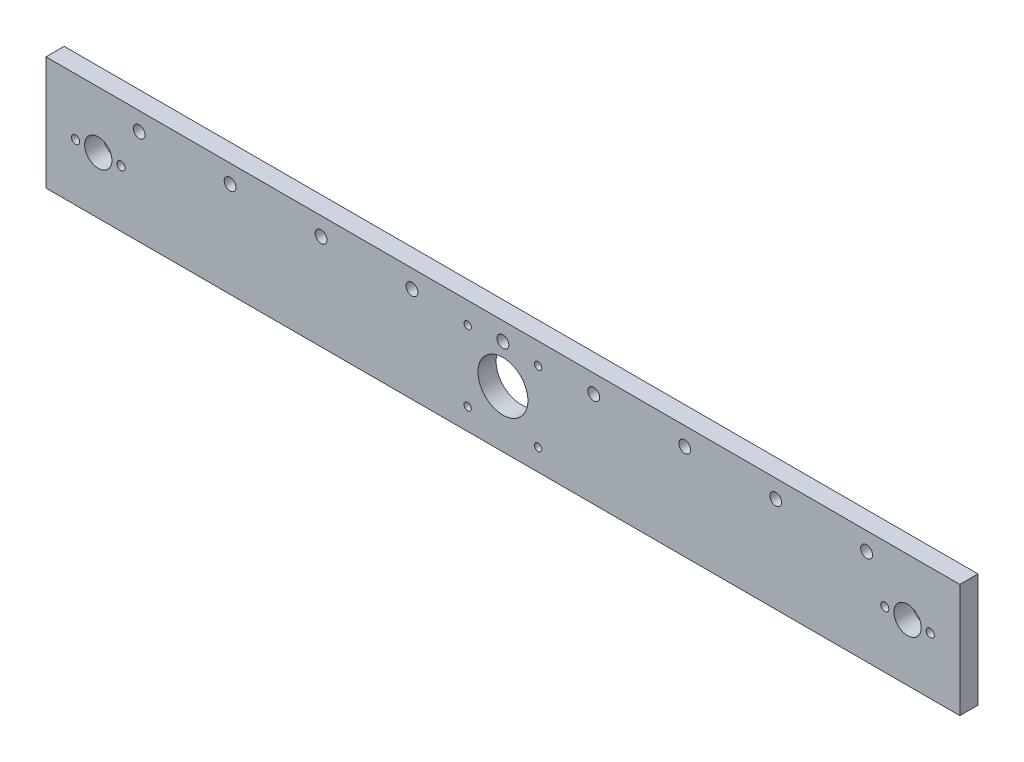
ISO-10303-21;
HEADER;
FILE_DESCRIPTION(('STEP AP214'),'2;1');
FILE_NAME('part.step','',(''),(''),'','','');
FILE_SCHEMA(('AUTOMOTIVE_DESIGN { 1 0 10303 214 1 1 1 1 }'));
ENDSEC;
DATA;
#1=APPLICATION_CONTEXT('core data for automotive mechanical design processes');
#2=APPLICATION_PROTOCOL_DEFINITION('international standard','automotive_design',2000,#1);
#3=PRODUCT_CONTEXT('',#1,'mechanical');
#4=PRODUCT('Part','Part','',(#3));
#5=PRODUCT_RELATED_PRODUCT_CATEGORY('part','',(#4));
#6=PRODUCT_DEFINITION_FORMATION('','',#4);
#7=PRODUCT_DEFINITION_CONTEXT('part definition',#1,'design');
#8=PRODUCT_DEFINITION('design','',#6,#7);
#9=PRODUCT_DEFINITION_SHAPE('','',#8);
#10=(LENGTH_UNIT() NAMED_UNIT(*) SI_UNIT(.MILLI.,.METRE.));
#11=(NAMED_UNIT(*) PLANE_ANGLE_UNIT() SI_UNIT($,.RADIAN.));
#12=(NAMED_UNIT(*) SI_UNIT($,.STERADIAN.) SOLID_ANGLE_UNIT());
#13=UNCERTAINTY_MEASURE_WITH_UNIT(LENGTH_MEASURE(1.E-05),#10,'distance_accuracy_value','');
#14=(GEOMETRIC_REPRESENTATION_CONTEXT(3) GLOBAL_UNCERTAINTY_ASSIGNED_CONTEXT((#13)) GLOBAL_UNIT_ASSIGNED_CONTEXT((#10,
#11,#12)) REPRESENTATION_CONTEXT('',''));
#15=CARTESIAN_POINT('',(0.,0.,0.));
#16=DIRECTION('',(0.,0.,1.));
#17=DIRECTION('',(1.,0.,0.));
#18=AXIS2_PLACEMENT_3D('',#15,#16,#17);
#19=CARTESIAN_POINT('',(0.,0.,8.));
#20=DIRECTION('',(0.,0.,-1.));
#21=DIRECTION('',(-1.,0.,0.));
#22=AXIS2_PLACEMENT_3D('',#19,#20,#21);
#23=PLANE('',#22);
#24=CARTESIAN_POINT('',(-120.,17.,8.));
#25=DIRECTION('',(0.,0.,1.));
#26=DIRECTION('',(1.,0.,0.));
#27=AXIS2_PLACEMENT_3D('',#24,#25,#26);
#28=CIRCLE('',#27,2.6);
#29=CARTESIAN_POINT('',(-117.4,17.,8.));
#30=VERTEX_POINT('',#29);
#31=EDGE_CURVE('E217',#30,#30,#28,.T.);
#32=ORIENTED_EDGE('',*,*,#31,.F.);
#33=EDGE_LOOP('',(#32));
#34=FACE_BOUND('',#33,.T.);
#35=CARTESIAN_POINT('',(-40.,17.,8.));
#36=DIRECTION('',(0.,0.,1.));
#37=DIRECTION('',(1.,0.,0.));
#38=AXIS2_PLACEMENT_3D('',#35,#36,#37);
#39=CIRCLE('',#38,2.6);
#40=CARTESIAN_POINT('',(-37.4,17.,8.));
#41=VERTEX_POINT('',#40);
#42=EDGE_CURVE('E205',#41,#41,#39,.T.);
#43=ORIENTED_EDGE('',*,*,#42,.F.);
#44=EDGE_LOOP('',(#43));
#45=FACE_BOUND('',#44,.T.);
#46=CARTESIAN_POINT('',(120.,17.,8.));
#47=DIRECTION('',(0.,0.,1.));
#48=DIRECTION('',(1.,0.,0.));
#49=AXIS2_PLACEMENT_3D('',#46,#47,#48);
#50=CIRCLE('',#49,2.6);
#51=CARTESIAN_POINT('',(122.6,17.,8.));
#52=VERTEX_POINT('',#51);
#53=EDGE_CURVE('E193',#52,#52,#50,.T.);
#54=ORIENTED_EDGE('',*,*,#53,.F.);
#55=EDGE_LOOP('',(#54));
#56=FACE_BOUND('',#55,.T.);
#57=CARTESIAN_POINT('',(40.,17.,8.));
#58=DIRECTION('',(0.,0.,1.));
#59=DIRECTION('',(1.,0.,0.));
#60=AXIS2_PLACEMENT_3D('',#57,#58,#59);
#61=CIRCLE('',#60,2.6);
#62=CARTESIAN_POINT('',(42.6,17.,8.));
#63=VERTEX_POINT('',#62);
#64=EDGE_CURVE('E181',#63,#63,#61,.T.);
#65=ORIENTED_EDGE('',*,*,#64,.F.);
#66=EDGE_LOOP('',(#65));
#67=FACE_BOUND('',#66,.T.);
#68=CARTESIAN_POINT('',(15.5,-15.5,8.));
#69=DIRECTION('',(0.,0.,1.));
#70=DIRECTION('',(1.,0.,0.));
#71=AXIS2_PLACEMENT_3D('',#68,#69,#70);
#72=CIRCLE('',#71,1.6);
#73=CARTESIAN_POINT('',(17.1,-15.5,8.));
#74=VERTEX_POINT('',#73);
#75=EDGE_CURVE('E169',#74,#74,#72,.T.);
#76=ORIENTED_EDGE('',*,*,#75,.F.);
#77=EDGE_LOOP('',(#76));
#78=FACE_BOUND('',#77,.T.);
#79=CARTESIAN_POINT('',(15.5,15.5,8.));
#80=DIRECTION('',(0.,0.,1.));
#81=DIRECTION('',(1.,0.,0.));
#82=AXIS2_PLACEMENT_3D('',#79,#80,#81);
#83=CIRCLE('',#82,1.6);
#84=CARTESIAN_POINT('',(17.1,15.5,8.));
#85=VERTEX_POINT('',#84);
#86=EDGE_CURVE('E157',#85,#85,#83,.T.);
#87=ORIENTED_EDGE('',*,*,#86,.F.);
#88=EDGE_LOOP('',(#87));
#89=FACE_BOUND('',#88,.T.);
#90=CARTESIAN_POINT('',(178.,0.,8.));
#91=DIRECTION('',(0.,0.,1.));
#92=DIRECTION('',(-1.,0.,0.));
#93=AXIS2_PLACEMENT_3D('',#90,#91,#92);
#94=CIRCLE('',#93,6.00000000000004);
#95=CARTESIAN_POINT('',(172.,0.,8.));
#96=VERTEX_POINT('',#95);
#97=EDGE_CURVE('E145',#96,#96,#94,.T.);
#98=ORIENTED_EDGE('',*,*,#97,.F.);
#99=EDGE_LOOP('',(#98));
#100=FACE_BOUND('',#99,.T.);
#101=CARTESIAN_POINT('',(-168.,0.,8.));
#102=DIRECTION('',(0.,0.,1.));
#103=DIRECTION('',(1.,0.,0.));
#104=AXIS2_PLACEMENT_3D('',#101,#102,#103);
#105=CIRCLE('',#104,1.80000000000001);
#106=CARTESIAN_POINT('',(-166.2,0.,8.));
#107=VERTEX_POINT('',#106);
#108=EDGE_CURVE('E133',#107,#107,#105,.T.);
#109=ORIENTED_EDGE('',*,*,#108,.F.);
#110=EDGE_LOOP('',(#109));
#111=FACE_BOUND('',#110,.T.);
#112=CARTESIAN_POINT('',(0.,0.,8.));
#113=DIRECTION('',(0.,0.,1.));
#114=DIRECTION('',(1.,0.,0.));
#115=AXIS2_PLACEMENT_3D('',#112,#113,#114);
#116=CIRCLE('',#115,11.);
#117=CARTESIAN_POINT('',(11.,0.,8.));
#118=VERTEX_POINT('',#117);
#119=EDGE_CURVE('E121',#118,#118,#116,.T.);
#120=ORIENTED_EDGE('',*,*,#119,.F.);
#121=EDGE_LOOP('',(#120));
#122=FACE_BOUND('',#121,.T.);
#123=CARTESIAN_POINT('',(-178.,0.,8.));
#124=DIRECTION('',(0.,0.,1.));
#125=DIRECTION('',(1.,0.,0.));
#126=AXIS2_PLACEMENT_3D('',#123,#124,#125);
#127=CIRCLE('',#126,5.99999999999999);
#128=CARTESIAN_POINT('',(-172.,0.,8.));
#129=VERTEX_POINT('',#128);
#130=EDGE_CURVE('E100',#129,#129,#127,.T.);
#131=ORIENTED_EDGE('',*,*,#130,.F.);
#132=EDGE_LOOP('',(#131));
#133=FACE_BOUND('',#132,.T.);
#134=DIRECTION('',(0.,1.,0.));
#135=VECTOR('',#134,1.);
#136=CARTESIAN_POINT('',(201.,-25.,8.));
#137=LINE('',#136,#135);
#138=CARTESIAN_POINT('',(201.,-25.,8.));
#139=VERTEX_POINT('',#138);
#140=CARTESIAN_POINT('',(201.,25.,8.));
#141=VERTEX_POINT('',#140);
#142=EDGE_CURVE('E85',#139,#141,#137,.T.);
#143=ORIENTED_EDGE('',*,*,#142,.T.);
#144=DIRECTION('',(-1.,0.,0.));
#145=VECTOR('',#144,1.);
#146=CARTESIAN_POINT('',(-201.,25.,8.));
#147=LINE('',#146,#145);
#148=CARTESIAN_POINT('',(-201.,25.,8.));
#149=VERTEX_POINT('',#148);
#150=EDGE_CURVE('E80',#141,#149,#147,.T.);
#151=ORIENTED_EDGE('',*,*,#150,.T.);
#152=DIRECTION('',(0.,-1.,0.));
#153=VECTOR('',#152,1.);
#154=CARTESIAN_POINT('',(-201.,-25.,8.));
#155=LINE('',#154,#153);
#156=CARTESIAN_POINT('',(-201.,-25.,8.));
#157=VERTEX_POINT('',#156);
#158=EDGE_CURVE('E83',#149,#157,#155,.T.);
#159=ORIENTED_EDGE('',*,*,#158,.T.);
#160=DIRECTION('',(1.,0.,0.));
#161=VECTOR('',#160,1.);
#162=CARTESIAN_POINT('',(-201.,-25.,8.));
#163=LINE('',#162,#161);
#164=EDGE_CURVE('E50',#157,#139,#163,.T.);
#165=ORIENTED_EDGE('',*,*,#164,.T.);
#166=EDGE_LOOP('',(#143,#151,#159,#165));
#167=FACE_BOUND('',#166,.T.);
#168=CARTESIAN_POINT('',(168.,0.,8.));
#169=DIRECTION('',(0.,0.,1.));
#170=DIRECTION('',(-1.,0.,0.));
#171=AXIS2_PLACEMENT_3D('',#168,#169,#170);
#172=CIRCLE('',#171,1.80000000000001);
#173=CARTESIAN_POINT('',(166.2,0.,8.));
#174=VERTEX_POINT('',#173);
#175=EDGE_CURVE('E115',#174,#174,#172,.T.);
#176=ORIENTED_EDGE('',*,*,#175,.F.);
#177=EDGE_LOOP('',(#176));
#178=FACE_BOUND('',#177,.T.);
#179=CARTESIAN_POINT('',(-188.,0.,8.));
#180=DIRECTION('',(0.,0.,1.));
#181=DIRECTION('',(1.,0.,0.));
#182=AXIS2_PLACEMENT_3D('',#179,#180,#181);
#183=CIRCLE('',#182,1.80000000000001);
#184=CARTESIAN_POINT('',(-186.2,0.,8.));
#185=VERTEX_POINT('',#184);
#186=EDGE_CURVE('E127',#185,#185,#183,.T.);
#187=ORIENTED_EDGE('',*,*,#186,.F.);
#188=EDGE_LOOP('',(#187));
#189=FACE_BOUND('',#188,.T.);
#190=CARTESIAN_POINT('',(188.,0.,8.));
#191=DIRECTION('',(0.,0.,1.));
#192=DIRECTION('',(-1.,0.,0.));
#193=AXIS2_PLACEMENT_3D('',#190,#191,#192);
#194=CIRCLE('',#193,1.80000000000001);
#195=CARTESIAN_POINT('',(186.2,0.,8.));
#196=VERTEX_POINT('',#195);
#197=EDGE_CURVE('E139',#196,#196,#194,.T.);
#198=ORIENTED_EDGE('',*,*,#197,.F.);
#199=EDGE_LOOP('',(#198));
#200=FACE_BOUND('',#199,.T.);
#201=CARTESIAN_POINT('',(-15.5,15.5,8.));
#202=DIRECTION('',(0.,0.,1.));
#203=DIRECTION('',(1.,0.,0.));
#204=AXIS2_PLACEMENT_3D('',#201,#202,#203);
#205=CIRCLE('',#204,1.6);
#206=CARTESIAN_POINT('',(-13.9,15.5,8.));
#207=VERTEX_POINT('',#206);
#208=EDGE_CURVE('E151',#207,#207,#205,.T.);
#209=ORIENTED_EDGE('',*,*,#208,.F.);
#210=EDGE_LOOP('',(#209));
#211=FACE_BOUND('',#210,.T.);
#212=CARTESIAN_POINT('',(-15.5,-15.5,8.));
#213=DIRECTION('',(0.,0.,1.));
#214=DIRECTION('',(1.,0.,0.));
#215=AXIS2_PLACEMENT_3D('',#212,#213,#214);
#216=CIRCLE('',#215,1.6);
#217=CARTESIAN_POINT('',(-13.9,-15.5,8.));
#218=VERTEX_POINT('',#217);
#219=EDGE_CURVE('E163',#218,#218,#216,.T.);
#220=ORIENTED_EDGE('',*,*,#219,.F.);
#221=EDGE_LOOP('',(#220));
#222=FACE_BOUND('',#221,.T.);
#223=CARTESIAN_POINT('',(0.,17.,8.));
#224=DIRECTION('',(0.,0.,1.));
#225=DIRECTION('',(1.,0.,0.));
#226=AXIS2_PLACEMENT_3D('',#223,#224,#225);
#227=CIRCLE('',#226,2.6);
#228=CARTESIAN_POINT('',(2.6,17.,8.));
#229=VERTEX_POINT('',#228);
#230=EDGE_CURVE('E175',#229,#229,#227,.T.);
#231=ORIENTED_EDGE('',*,*,#230,.F.);
#232=EDGE_LOOP('',(#231));
#233=FACE_BOUND('',#232,.T.);
#234=CARTESIAN_POINT('',(80.,17.,8.));
#235=DIRECTION('',(0.,0.,1.));
#236=DIRECTION('',(1.,0.,0.));
#237=AXIS2_PLACEMENT_3D('',#234,#235,#236);
#238=CIRCLE('',#237,2.6);
#239=CARTESIAN_POINT('',(82.6,17.,8.));
#240=VERTEX_POINT('',#239);
#241=EDGE_CURVE('E187',#240,#240,#238,.T.);
#242=ORIENTED_EDGE('',*,*,#241,.F.);
#243=EDGE_LOOP('',(#242));
#244=FACE_BOUND('',#243,.T.);
#245=CARTESIAN_POINT('',(160.,17.,8.));
#246=DIRECTION('',(0.,0.,1.));
#247=DIRECTION('',(1.,0.,0.));
#248=AXIS2_PLACEMENT_3D('',#245,#246,#247);
#249=CIRCLE('',#248,2.59999999999999);
#250=CARTESIAN_POINT('',(162.6,17.,8.));
#251=VERTEX_POINT('',#250);
#252=EDGE_CURVE('E199',#251,#251,#249,.T.);
#253=ORIENTED_EDGE('',*,*,#252,.F.);
#254=EDGE_LOOP('',(#253));
#255=FACE_BOUND('',#254,.T.);
#256=CARTESIAN_POINT('',(-80.,17.,8.));
#257=DIRECTION('',(0.,0.,1.));
#258=DIRECTION('',(1.,0.,0.));
#259=AXIS2_PLACEMENT_3D('',#256,#257,#258);
#260=CIRCLE('',#259,2.6);
#261=CARTESIAN_POINT('',(-77.4,17.,8.));
#262=VERTEX_POINT('',#261);
#263=EDGE_CURVE('E211',#262,#262,#260,.T.);
#264=ORIENTED_EDGE('',*,*,#263,.F.);
#265=EDGE_LOOP('',(#264));
#266=FACE_BOUND('',#265,.T.);
#267=CARTESIAN_POINT('',(-160.,17.,8.));
#268=DIRECTION('',(0.,0.,1.));
#269=DIRECTION('',(1.,0.,0.));
#270=AXIS2_PLACEMENT_3D('',#267,#268,#269);
#271=CIRCLE('',#270,2.59999999999999);
#272=CARTESIAN_POINT('',(-157.4,17.,8.));
#273=VERTEX_POINT('',#272);
#274=EDGE_CURVE('E223',#273,#273,#271,.T.);
#275=ORIENTED_EDGE('',*,*,#274,.F.);
#276=EDGE_LOOP('',(#275));
#277=FACE_BOUND('',#276,.T.);
#278=ADVANCED_FACE('F33',(#34,#45,#56,#67,#78,#89,#100,#111,#122,#133,#167,#178,#189,#200,#211,
#222,#233,#244,#255,#266,#277),#23,.F.);
#279=CARTESIAN_POINT('',(0.,0.,0.));
#280=DIRECTION('',(0.,0.,-1.));
#281=DIRECTION('',(-1.,0.,0.));
#282=AXIS2_PLACEMENT_3D('',#279,#280,#281);
#283=PLANE('',#282);
#284=CARTESIAN_POINT('',(-120.,17.,0.));
#285=DIRECTION('',(0.,0.,1.));
#286=DIRECTION('',(1.,0.,0.));
#287=AXIS2_PLACEMENT_3D('',#284,#285,#286);
#288=CIRCLE('',#287,2.6);
#289=CARTESIAN_POINT('',(-117.4,17.,0.));
#290=VERTEX_POINT('',#289);
#291=EDGE_CURVE('E220',#290,#290,#288,.T.);
#292=ORIENTED_EDGE('',*,*,#291,.T.);
#293=EDGE_LOOP('',(#292));
#294=FACE_BOUND('',#293,.T.);
#295=CARTESIAN_POINT('',(-40.,17.,0.));
#296=DIRECTION('',(0.,0.,1.));
#297=DIRECTION('',(1.,0.,0.));
#298=AXIS2_PLACEMENT_3D('',#295,#296,#297);
#299=CIRCLE('',#298,2.6);
#300=CARTESIAN_POINT('',(-37.4,17.,0.));
#301=VERTEX_POINT('',#300);
#302=EDGE_CURVE('E208',#301,#301,#299,.T.);
#303=ORIENTED_EDGE('',*,*,#302,.T.);
#304=EDGE_LOOP('',(#303));
#305=FACE_BOUND('',#304,.T.);
#306=CARTESIAN_POINT('',(120.,17.,0.));
#307=DIRECTION('',(0.,0.,1.));
#308=DIRECTION('',(1.,0.,0.));
#309=AXIS2_PLACEMENT_3D('',#306,#307,#308);
#310=CIRCLE('',#309,2.6);
#311=CARTESIAN_POINT('',(122.6,17.,0.));
#312=VERTEX_POINT('',#311);
#313=EDGE_CURVE('E196',#312,#312,#310,.T.);
#314=ORIENTED_EDGE('',*,*,#313,.T.);
#315=EDGE_LOOP('',(#314));
#316=FACE_BOUND('',#315,.T.);
#317=CARTESIAN_POINT('',(40.,17.,0.));
#318=DIRECTION('',(0.,0.,1.));
#319=DIRECTION('',(1.,0.,0.));
#320=AXIS2_PLACEMENT_3D('',#317,#318,#319);
#321=CIRCLE('',#320,2.6);
#322=CARTESIAN_POINT('',(42.6,17.,0.));
#323=VERTEX_POINT('',#322);
#324=EDGE_CURVE('E184',#323,#323,#321,.T.);
#325=ORIENTED_EDGE('',*,*,#324,.T.);
#326=EDGE_LOOP('',(#325));
#327=FACE_BOUND('',#326,.T.);
#328=CARTESIAN_POINT('',(15.5,-15.5,0.));
#329=DIRECTION('',(0.,0.,1.));
#330=DIRECTION('',(1.,0.,0.));
#331=AXIS2_PLACEMENT_3D('',#328,#329,#330);
#332=CIRCLE('',#331,1.6);
#333=CARTESIAN_POINT('',(17.1,-15.5,0.));
#334=VERTEX_POINT('',#333);
#335=EDGE_CURVE('E172',#334,#334,#332,.T.);
#336=ORIENTED_EDGE('',*,*,#335,.T.);
#337=EDGE_LOOP('',(#336));
#338=FACE_BOUND('',#337,.T.);
#339=CARTESIAN_POINT('',(15.5,15.5,0.));
#340=DIRECTION('',(0.,0.,1.));
#341=DIRECTION('',(1.,0.,0.));
#342=AXIS2_PLACEMENT_3D('',#339,#340,#341);
#343=CIRCLE('',#342,1.6);
#344=CARTESIAN_POINT('',(17.1,15.5,0.));
#345=VERTEX_POINT('',#344);
#346=EDGE_CURVE('E160',#345,#345,#343,.T.);
#347=ORIENTED_EDGE('',*,*,#346,.T.);
#348=EDGE_LOOP('',(#347));
#349=FACE_BOUND('',#348,.T.);
#350=CARTESIAN_POINT('',(178.,0.,0.));
#351=DIRECTION('',(0.,0.,1.));
#352=DIRECTION('',(-1.,0.,0.));
#353=AXIS2_PLACEMENT_3D('',#350,#351,#352);
#354=CIRCLE('',#353,6.00000000000004);
#355=CARTESIAN_POINT('',(172.,0.,0.));
#356=VERTEX_POINT('',#355);
#357=EDGE_CURVE('E148',#356,#356,#354,.T.);
#358=ORIENTED_EDGE('',*,*,#357,.T.);
#359=EDGE_LOOP('',(#358));
#360=FACE_BOUND('',#359,.T.);
#361=CARTESIAN_POINT('',(-168.,0.,0.));
#362=DIRECTION('',(0.,0.,1.));
#363=DIRECTION('',(1.,0.,0.));
#364=AXIS2_PLACEMENT_3D('',#361,#362,#363);
#365=CIRCLE('',#364,1.80000000000001);
#366=CARTESIAN_POINT('',(-166.2,0.,0.));
#367=VERTEX_POINT('',#366);
#368=EDGE_CURVE('E136',#367,#367,#365,.T.);
#369=ORIENTED_EDGE('',*,*,#368,.T.);
#370=EDGE_LOOP('',(#369));
#371=FACE_BOUND('',#370,.T.);
#372=CARTESIAN_POINT('',(0.,0.,0.));
#373=DIRECTION('',(0.,0.,1.));
#374=DIRECTION('',(1.,0.,0.));
#375=AXIS2_PLACEMENT_3D('',#372,#373,#374);
#376=CIRCLE('',#375,11.);
#377=CARTESIAN_POINT('',(11.,0.,0.));
#378=VERTEX_POINT('',#377);
#379=EDGE_CURVE('E124',#378,#378,#376,.T.);
#380=ORIENTED_EDGE('',*,*,#379,.T.);
#381=EDGE_LOOP('',(#380));
#382=FACE_BOUND('',#381,.T.);
#383=CARTESIAN_POINT('',(-178.,0.,0.));
#384=DIRECTION('',(0.,0.,1.));
#385=DIRECTION('',(1.,0.,0.));
#386=AXIS2_PLACEMENT_3D('',#383,#384,#385);
#387=CIRCLE('',#386,5.99999999999999);
#388=CARTESIAN_POINT('',(-172.,0.,0.));
#389=VERTEX_POINT('',#388);
#390=EDGE_CURVE('E112',#389,#389,#387,.T.);
#391=ORIENTED_EDGE('',*,*,#390,.T.);
#392=EDGE_LOOP('',(#391));
#393=FACE_BOUND('',#392,.T.);
#394=DIRECTION('',(0.,1.,0.));
#395=VECTOR('',#394,1.);
#396=CARTESIAN_POINT('',(201.,-25.,0.));
#397=LINE('',#396,#395);
#398=CARTESIAN_POINT('',(201.,-25.,0.));
#399=VERTEX_POINT('',#398);
#400=CARTESIAN_POINT('',(201.,25.,0.));
#401=VERTEX_POINT('',#400);
#402=EDGE_CURVE('E97',#399,#401,#397,.T.);
#403=ORIENTED_EDGE('',*,*,#402,.F.);
#404=DIRECTION('',(1.,0.,0.));
#405=VECTOR('',#404,1.);
#406=CARTESIAN_POINT('',(-201.,-25.,0.));
#407=LINE('',#406,#405);
#408=CARTESIAN_POINT('',(-201.,-25.,0.));
#409=VERTEX_POINT('',#408);
#410=EDGE_CURVE('E73',#409,#399,#407,.T.);
#411=ORIENTED_EDGE('',*,*,#410,.F.);
#412=DIRECTION('',(0.,-1.,0.));
#413=VECTOR('',#412,1.);
#414=CARTESIAN_POINT('',(-201.,-25.,0.));
#415=LINE('',#414,#413);
#416=CARTESIAN_POINT('',(-201.,25.,0.));
#417=VERTEX_POINT('',#416);
#418=EDGE_CURVE('E67',#417,#409,#415,.T.);
#419=ORIENTED_EDGE('',*,*,#418,.F.);
#420=DIRECTION('',(-1.,0.,0.));
#421=VECTOR('',#420,1.);
#422=CARTESIAN_POINT('',(-201.,25.,0.));
#423=LINE('',#422,#421);
#424=EDGE_CURVE('E89',#401,#417,#423,.T.);
#425=ORIENTED_EDGE('',*,*,#424,.F.);
#426=EDGE_LOOP('',(#403,#411,#419,#425));
#427=FACE_BOUND('',#426,.T.);
#428=CARTESIAN_POINT('',(168.,0.,0.));
#429=DIRECTION('',(0.,0.,1.));
#430=DIRECTION('',(-1.,0.,0.));
#431=AXIS2_PLACEMENT_3D('',#428,#429,#430);
#432=CIRCLE('',#431,1.80000000000001);
#433=CARTESIAN_POINT('',(166.2,0.,0.));
#434=VERTEX_POINT('',#433);
#435=EDGE_CURVE('E118',#434,#434,#432,.T.);
#436=ORIENTED_EDGE('',*,*,#435,.T.);
#437=EDGE_LOOP('',(#436));
#438=FACE_BOUND('',#437,.T.);
#439=CARTESIAN_POINT('',(-188.,0.,0.));
#440=DIRECTION('',(0.,0.,1.));
#441=DIRECTION('',(1.,0.,0.));
#442=AXIS2_PLACEMENT_3D('',#439,#440,#441);
#443=CIRCLE('',#442,1.80000000000001);
#444=CARTESIAN_POINT('',(-186.2,0.,0.));
#445=VERTEX_POINT('',#444);
#446=EDGE_CURVE('E130',#445,#445,#443,.T.);
#447=ORIENTED_EDGE('',*,*,#446,.T.);
#448=EDGE_LOOP('',(#447));
#449=FACE_BOUND('',#448,.T.);
#450=CARTESIAN_POINT('',(188.,0.,0.));
#451=DIRECTION('',(0.,0.,1.));
#452=DIRECTION('',(-1.,0.,0.));
#453=AXIS2_PLACEMENT_3D('',#450,#451,#452);
#454=CIRCLE('',#453,1.80000000000001);
#455=CARTESIAN_POINT('',(186.2,0.,0.));
#456=VERTEX_POINT('',#455);
#457=EDGE_CURVE('E142',#456,#456,#454,.T.);
#458=ORIENTED_EDGE('',*,*,#457,.T.);
#459=EDGE_LOOP('',(#458));
#460=FACE_BOUND('',#459,.T.);
#461=CARTESIAN_POINT('',(-15.5,15.5,0.));
#462=DIRECTION('',(0.,0.,1.));
#463=DIRECTION('',(1.,0.,0.));
#464=AXIS2_PLACEMENT_3D('',#461,#462,#463);
#465=CIRCLE('',#464,1.6);
#466=CARTESIAN_POINT('',(-13.9,15.5,0.));
#467=VERTEX_POINT('',#466);
#468=EDGE_CURVE('E154',#467,#467,#465,.T.);
#469=ORIENTED_EDGE('',*,*,#468,.T.);
#470=EDGE_LOOP('',(#469));
#471=FACE_BOUND('',#470,.T.);
#472=CARTESIAN_POINT('',(-15.5,-15.5,0.));
#473=DIRECTION('',(0.,0.,1.));
#474=DIRECTION('',(1.,0.,0.));
#475=AXIS2_PLACEMENT_3D('',#472,#473,#474);
#476=CIRCLE('',#475,1.6);
#477=CARTESIAN_POINT('',(-13.9,-15.5,0.));
#478=VERTEX_POINT('',#477);
#479=EDGE_CURVE('E166',#478,#478,#476,.T.);
#480=ORIENTED_EDGE('',*,*,#479,.T.);
#481=EDGE_LOOP('',(#480));
#482=FACE_BOUND('',#481,.T.);
#483=CARTESIAN_POINT('',(0.,17.,0.));
#484=DIRECTION('',(0.,0.,1.));
#485=DIRECTION('',(1.,0.,0.));
#486=AXIS2_PLACEMENT_3D('',#483,#484,#485);
#487=CIRCLE('',#486,2.6);
#488=CARTESIAN_POINT('',(2.6,17.,0.));
#489=VERTEX_POINT('',#488);
#490=EDGE_CURVE('E178',#489,#489,#487,.T.);
#491=ORIENTED_EDGE('',*,*,#490,.T.);
#492=EDGE_LOOP('',(#491));
#493=FACE_BOUND('',#492,.T.);
#494=CARTESIAN_POINT('',(80.,17.,0.));
#495=DIRECTION('',(0.,0.,1.));
#496=DIRECTION('',(1.,0.,0.));
#497=AXIS2_PLACEMENT_3D('',#494,#495,#496);
#498=CIRCLE('',#497,2.6);
#499=CARTESIAN_POINT('',(82.6,17.,0.));
#500=VERTEX_POINT('',#499);
#501=EDGE_CURVE('E190',#500,#500,#498,.T.);
#502=ORIENTED_EDGE('',*,*,#501,.T.);
#503=EDGE_LOOP('',(#502));
#504=FACE_BOUND('',#503,.T.);
#505=CARTESIAN_POINT('',(160.,17.,0.));
#506=DIRECTION('',(0.,0.,1.));
#507=DIRECTION('',(1.,0.,0.));
#508=AXIS2_PLACEMENT_3D('',#505,#506,#507);
#509=CIRCLE('',#508,2.59999999999999);
#510=CARTESIAN_POINT('',(162.6,17.,0.));
#511=VERTEX_POINT('',#510);
#512=EDGE_CURVE('E202',#511,#511,#509,.T.);
#513=ORIENTED_EDGE('',*,*,#512,.T.);
#514=EDGE_LOOP('',(#513));
#515=FACE_BOUND('',#514,.T.);
#516=CARTESIAN_POINT('',(-80.,17.,0.));
#517=DIRECTION('',(0.,0.,1.));
#518=DIRECTION('',(1.,0.,0.));
#519=AXIS2_PLACEMENT_3D('',#516,#517,#518);
#520=CIRCLE('',#519,2.6);
#521=CARTESIAN_POINT('',(-77.4,17.,0.));
#522=VERTEX_POINT('',#521);
#523=EDGE_CURVE('E214',#522,#522,#520,.T.);
#524=ORIENTED_EDGE('',*,*,#523,.T.);
#525=EDGE_LOOP('',(#524));
#526=FACE_BOUND('',#525,.T.);
#527=CARTESIAN_POINT('',(-160.,17.,0.));
#528=DIRECTION('',(0.,0.,1.));
#529=DIRECTION('',(1.,0.,0.));
#530=AXIS2_PLACEMENT_3D('',#527,#528,#529);
#531=CIRCLE('',#530,2.59999999999999);
#532=CARTESIAN_POINT('',(-157.4,17.,0.));
#533=VERTEX_POINT('',#532);
#534=EDGE_CURVE('E226',#533,#533,#531,.T.);
#535=ORIENTED_EDGE('',*,*,#534,.T.);
#536=EDGE_LOOP('',(#535));
#537=FACE_BOUND('',#536,.T.);
#538=ADVANCED_FACE('F108',(#294,#305,#316,#327,#338,#349,#360,#371,#382,#393,#427,#438,#449,
#460,#471,#482,#493,#504,#515,#526,#537),#283,.T.);
#539=CARTESIAN_POINT('',(201.,-25.,8.));
#540=DIRECTION('',(-1.,0.,0.));
#541=DIRECTION('',(0.,0.,1.));
#542=AXIS2_PLACEMENT_3D('',#539,#540,#541);
#543=PLANE('',#542);
#544=ORIENTED_EDGE('',*,*,#402,.T.);
#545=DIRECTION('',(0.,0.,-1.));
#546=VECTOR('',#545,1.);
#547=CARTESIAN_POINT('',(201.,25.,8.));
#548=LINE('',#547,#546);
#549=EDGE_CURVE('E11',#141,#401,#548,.T.);
#550=ORIENTED_EDGE('',*,*,#549,.F.);
#551=ORIENTED_EDGE('',*,*,#142,.F.);
#552=DIRECTION('',(0.,0.,-1.));
#553=VECTOR('',#552,1.);
#554=CARTESIAN_POINT('',(201.,-25.,8.));
#555=LINE('',#554,#553);
#556=EDGE_CURVE('E93',#139,#399,#555,.T.);
#557=ORIENTED_EDGE('',*,*,#556,.T.);
#558=EDGE_LOOP('',(#544,#550,#551,#557));
#559=FACE_BOUND('',#558,.T.);
#560=ADVANCED_FACE('F35',(#559),#543,.F.);
#561=CARTESIAN_POINT('',(-201.,25.,8.));
#562=DIRECTION('',(0.,-1.,0.));
#563=DIRECTION('',(0.,0.,-1.));
#564=AXIS2_PLACEMENT_3D('',#561,#562,#563);
#565=PLANE('',#564);
#566=ORIENTED_EDGE('',*,*,#424,.T.);
#567=DIRECTION('',(0.,0.,-1.));
#568=VECTOR('',#567,1.);
#569=CARTESIAN_POINT('',(-201.,25.,8.));
#570=LINE('',#569,#568);
#571=EDGE_CURVE('E42',#149,#417,#570,.T.);
#572=ORIENTED_EDGE('',*,*,#571,.F.);
#573=ORIENTED_EDGE('',*,*,#150,.F.);
#574=ORIENTED_EDGE('',*,*,#549,.T.);
#575=EDGE_LOOP('',(#566,#572,#573,#574));
#576=FACE_BOUND('',#575,.T.);
#577=ADVANCED_FACE('F88',(#576),#565,.F.);
#578=CARTESIAN_POINT('',(-201.,-25.,8.));
#579=DIRECTION('',(1.,0.,0.));
#580=DIRECTION('',(0.,0.,-1.));
#581=AXIS2_PLACEMENT_3D('',#578,#579,#580);
#582=PLANE('',#581);
#583=ORIENTED_EDGE('',*,*,#418,.T.);
#584=DIRECTION('',(0.,0.,-1.));
#585=VECTOR('',#584,1.);
#586=CARTESIAN_POINT('',(-201.,-25.,8.));
#587=LINE('',#586,#585);
#588=EDGE_CURVE('E90',#157,#409,#587,.T.);
#589=ORIENTED_EDGE('',*,*,#588,.F.);
#590=ORIENTED_EDGE('',*,*,#158,.F.);
#591=ORIENTED_EDGE('',*,*,#571,.T.);
#592=EDGE_LOOP('',(#583,#589,#590,#591));
#593=FACE_BOUND('',#592,.T.);
#594=ADVANCED_FACE('F91',(#593),#582,.F.);
#595=CARTESIAN_POINT('',(-201.,-25.,8.));
#596=DIRECTION('',(0.,1.,0.));
#597=DIRECTION('',(0.,0.,1.));
#598=AXIS2_PLACEMENT_3D('',#595,#596,#597);
#599=PLANE('',#598);
#600=ORIENTED_EDGE('',*,*,#410,.T.);
#601=ORIENTED_EDGE('',*,*,#556,.F.);
#602=ORIENTED_EDGE('',*,*,#164,.F.);
#603=ORIENTED_EDGE('',*,*,#588,.T.);
#604=EDGE_LOOP('',(#600,#601,#602,#603));
#605=FACE_BOUND('',#604,.T.);
#606=ADVANCED_FACE('F105',(#605),#599,.F.);
#607=CARTESIAN_POINT('',(-178.,0.,8.));
#608=DIRECTION('',(0.,0.,-1.));
#609=DIRECTION('',(-1.,0.,0.));
#610=AXIS2_PLACEMENT_3D('',#607,#608,#609);
#611=CYLINDRICAL_SURFACE('',#610,5.99999999999999);
#612=ORIENTED_EDGE('',*,*,#130,.T.);
#613=EDGE_LOOP('',(#612));
#614=FACE_BOUND('',#613,.T.);
#615=ORIENTED_EDGE('',*,*,#390,.F.);
#616=EDGE_LOOP('',(#615));
#617=FACE_BOUND('',#616,.T.);
#618=ADVANCED_FACE('F246',(#614,#617),#611,.F.);
#619=CARTESIAN_POINT('',(168.,0.,8.));
#620=DIRECTION('',(0.,0.,-1.));
#621=DIRECTION('',(-1.,0.,0.));
#622=AXIS2_PLACEMENT_3D('',#619,#620,#621);
#623=CYLINDRICAL_SURFACE('',#622,1.80000000000001);
#624=ORIENTED_EDGE('',*,*,#175,.T.);
#625=EDGE_LOOP('',(#624));
#626=FACE_BOUND('',#625,.T.);
#627=ORIENTED_EDGE('',*,*,#435,.F.);
#628=EDGE_LOOP('',(#627));
#629=FACE_BOUND('',#628,.T.);
#630=ADVANCED_FACE('F292',(#626,#629),#623,.F.);
#631=CARTESIAN_POINT('',(0.,0.,8.));
#632=DIRECTION('',(0.,0.,-1.));
#633=DIRECTION('',(-1.,0.,0.));
#634=AXIS2_PLACEMENT_3D('',#631,#632,#633);
#635=CYLINDRICAL_SURFACE('',#634,11.);
#636=ORIENTED_EDGE('',*,*,#119,.T.);
#637=EDGE_LOOP('',(#636));
#638=FACE_BOUND('',#637,.T.);
#639=ORIENTED_EDGE('',*,*,#379,.F.);
#640=EDGE_LOOP('',(#639));
#641=FACE_BOUND('',#640,.T.);
#642=ADVANCED_FACE('F300',(#638,#641),#635,.F.);
#643=CARTESIAN_POINT('',(-188.,0.,8.));
#644=DIRECTION('',(0.,0.,-1.));
#645=DIRECTION('',(-1.,0.,0.));
#646=AXIS2_PLACEMENT_3D('',#643,#644,#645);
#647=CYLINDRICAL_SURFACE('',#646,1.80000000000001);
#648=ORIENTED_EDGE('',*,*,#186,.T.);
#649=EDGE_LOOP('',(#648));
#650=FACE_BOUND('',#649,.T.);
#651=ORIENTED_EDGE('',*,*,#446,.F.);
#652=EDGE_LOOP('',(#651));
#653=FACE_BOUND('',#652,.T.);
#654=ADVANCED_FACE('F308',(#650,#653),#647,.F.);
#655=CARTESIAN_POINT('',(-168.,0.,8.));
#656=DIRECTION('',(0.,0.,-1.));
#657=DIRECTION('',(-1.,0.,0.));
#658=AXIS2_PLACEMENT_3D('',#655,#656,#657);
#659=CYLINDRICAL_SURFACE('',#658,1.80000000000001);
#660=ORIENTED_EDGE('',*,*,#108,.T.);
#661=EDGE_LOOP('',(#660));
#662=FACE_BOUND('',#661,.T.);
#663=ORIENTED_EDGE('',*,*,#368,.F.);
#664=EDGE_LOOP('',(#663));
#665=FACE_BOUND('',#664,.T.);
#666=ADVANCED_FACE('F317',(#662,#665),#659,.F.);
#667=CARTESIAN_POINT('',(188.,0.,8.));
#668=DIRECTION('',(0.,0.,-1.));
#669=DIRECTION('',(-1.,0.,0.));
#670=AXIS2_PLACEMENT_3D('',#667,#668,#669);
#671=CYLINDRICAL_SURFACE('',#670,1.80000000000001);
#672=ORIENTED_EDGE('',*,*,#197,.T.);
#673=EDGE_LOOP('',(#672));
#674=FACE_BOUND('',#673,.T.);
#675=ORIENTED_EDGE('',*,*,#457,.F.);
#676=EDGE_LOOP('',(#675));
#677=FACE_BOUND('',#676,.T.);
#678=ADVANCED_FACE('F326',(#674,#677),#671,.F.);
#679=CARTESIAN_POINT('',(178.,0.,8.));
#680=DIRECTION('',(0.,0.,-1.));
#681=DIRECTION('',(-1.,0.,0.));
#682=AXIS2_PLACEMENT_3D('',#679,#680,#681);
#683=CYLINDRICAL_SURFACE('',#682,6.00000000000004);
#684=ORIENTED_EDGE('',*,*,#97,.T.);
#685=EDGE_LOOP('',(#684));
#686=FACE_BOUND('',#685,.T.);
#687=ORIENTED_EDGE('',*,*,#357,.F.);
#688=EDGE_LOOP('',(#687));
#689=FACE_BOUND('',#688,.T.);
#690=ADVANCED_FACE('F335',(#686,#689),#683,.F.);
#691=CARTESIAN_POINT('',(-15.5,15.5,8.));
#692=DIRECTION('',(0.,0.,-1.));
#693=DIRECTION('',(-1.,0.,0.));
#694=AXIS2_PLACEMENT_3D('',#691,#692,#693);
#695=CYLINDRICAL_SURFACE('',#694,1.6);
#696=ORIENTED_EDGE('',*,*,#208,.T.);
#697=EDGE_LOOP('',(#696));
#698=FACE_BOUND('',#697,.T.);
#699=ORIENTED_EDGE('',*,*,#468,.F.);
#700=EDGE_LOOP('',(#699));
#701=FACE_BOUND('',#700,.T.);
#702=ADVANCED_FACE('F344',(#698,#701),#695,.F.);
#703=CARTESIAN_POINT('',(15.5,15.5,8.));
#704=DIRECTION('',(0.,0.,-1.));
#705=DIRECTION('',(-1.,0.,0.));
#706=AXIS2_PLACEMENT_3D('',#703,#704,#705);
#707=CYLINDRICAL_SURFACE('',#706,1.6);
#708=ORIENTED_EDGE('',*,*,#86,.T.);
#709=EDGE_LOOP('',(#708));
#710=FACE_BOUND('',#709,.T.);
#711=ORIENTED_EDGE('',*,*,#346,.F.);
#712=EDGE_LOOP('',(#711));
#713=FACE_BOUND('',#712,.T.);
#714=ADVANCED_FACE('F353',(#710,#713),#707,.F.);
#715=CARTESIAN_POINT('',(-15.5,-15.5,8.));
#716=DIRECTION('',(0.,0.,-1.));
#717=DIRECTION('',(-1.,0.,0.));
#718=AXIS2_PLACEMENT_3D('',#715,#716,#717);
#719=CYLINDRICAL_SURFACE('',#718,1.6);
#720=ORIENTED_EDGE('',*,*,#219,.T.);
#721=EDGE_LOOP('',(#720));
#722=FACE_BOUND('',#721,.T.);
#723=ORIENTED_EDGE('',*,*,#479,.F.);
#724=EDGE_LOOP('',(#723));
#725=FACE_BOUND('',#724,.T.);
#726=ADVANCED_FACE('F362',(#722,#725),#719,.F.);
#727=CARTESIAN_POINT('',(15.5,-15.5,8.));
#728=DIRECTION('',(0.,0.,-1.));
#729=DIRECTION('',(-1.,0.,0.));
#730=AXIS2_PLACEMENT_3D('',#727,#728,#729);
#731=CYLINDRICAL_SURFACE('',#730,1.6);
#732=ORIENTED_EDGE('',*,*,#75,.T.);
#733=EDGE_LOOP('',(#732));
#734=FACE_BOUND('',#733,.T.);
#735=ORIENTED_EDGE('',*,*,#335,.F.);
#736=EDGE_LOOP('',(#735));
#737=FACE_BOUND('',#736,.T.);
#738=ADVANCED_FACE('F371',(#734,#737),#731,.F.);
#739=CARTESIAN_POINT('',(0.,17.,8.));
#740=DIRECTION('',(0.,0.,-1.));
#741=DIRECTION('',(-1.,0.,0.));
#742=AXIS2_PLACEMENT_3D('',#739,#740,#741);
#743=CYLINDRICAL_SURFACE('',#742,2.6);
#744=ORIENTED_EDGE('',*,*,#230,.T.);
#745=EDGE_LOOP('',(#744));
#746=FACE_BOUND('',#745,.T.);
#747=ORIENTED_EDGE('',*,*,#490,.F.);
#748=EDGE_LOOP('',(#747));
#749=FACE_BOUND('',#748,.T.);
#750=ADVANCED_FACE('F380',(#746,#749),#743,.F.);
#751=CARTESIAN_POINT('',(40.,17.,8.));
#752=DIRECTION('',(0.,0.,-1.));
#753=DIRECTION('',(-1.,0.,0.));
#754=AXIS2_PLACEMENT_3D('',#751,#752,#753);
#755=CYLINDRICAL_SURFACE('',#754,2.6);
#756=ORIENTED_EDGE('',*,*,#64,.T.);
#757=EDGE_LOOP('',(#756));
#758=FACE_BOUND('',#757,.T.);
#759=ORIENTED_EDGE('',*,*,#324,.F.);
#760=EDGE_LOOP('',(#759));
#761=FACE_BOUND('',#760,.T.);
#762=ADVANCED_FACE('F389',(#758,#761),#755,.F.);
#763=CARTESIAN_POINT('',(80.,17.,8.));
#764=DIRECTION('',(0.,0.,-1.));
#765=DIRECTION('',(-1.,0.,0.));
#766=AXIS2_PLACEMENT_3D('',#763,#764,#765);
#767=CYLINDRICAL_SURFACE('',#766,2.6);
#768=ORIENTED_EDGE('',*,*,#241,.T.);
#769=EDGE_LOOP('',(#768));
#770=FACE_BOUND('',#769,.T.);
#771=ORIENTED_EDGE('',*,*,#501,.F.);
#772=EDGE_LOOP('',(#771));
#773=FACE_BOUND('',#772,.T.);
#774=ADVANCED_FACE('F398',(#770,#773),#767,.F.);
#775=CARTESIAN_POINT('',(120.,17.,8.));
#776=DIRECTION('',(0.,0.,-1.));
#777=DIRECTION('',(-1.,0.,0.));
#778=AXIS2_PLACEMENT_3D('',#775,#776,#777);
#779=CYLINDRICAL_SURFACE('',#778,2.6);
#780=ORIENTED_EDGE('',*,*,#53,.T.);
#781=EDGE_LOOP('',(#780));
#782=FACE_BOUND('',#781,.T.);
#783=ORIENTED_EDGE('',*,*,#313,.F.);
#784=EDGE_LOOP('',(#783));
#785=FACE_BOUND('',#784,.T.);
#786=ADVANCED_FACE('F407',(#782,#785),#779,.F.);
#787=CARTESIAN_POINT('',(160.,17.,8.));
#788=DIRECTION('',(0.,0.,-1.));
#789=DIRECTION('',(-1.,0.,0.));
#790=AXIS2_PLACEMENT_3D('',#787,#788,#789);
#791=CYLINDRICAL_SURFACE('',#790,2.59999999999999);
#792=ORIENTED_EDGE('',*,*,#252,.T.);
#793=EDGE_LOOP('',(#792));
#794=FACE_BOUND('',#793,.T.);
#795=ORIENTED_EDGE('',*,*,#512,.F.);
#796=EDGE_LOOP('',(#795));
#797=FACE_BOUND('',#796,.T.);
#798=ADVANCED_FACE('F416',(#794,#797),#791,.F.);
#799=CARTESIAN_POINT('',(-40.,17.,8.));
#800=DIRECTION('',(0.,0.,-1.));
#801=DIRECTION('',(-1.,0.,0.));
#802=AXIS2_PLACEMENT_3D('',#799,#800,#801);
#803=CYLINDRICAL_SURFACE('',#802,2.6);
#804=ORIENTED_EDGE('',*,*,#42,.T.);
#805=EDGE_LOOP('',(#804));
#806=FACE_BOUND('',#805,.T.);
#807=ORIENTED_EDGE('',*,*,#302,.F.);
#808=EDGE_LOOP('',(#807));
#809=FACE_BOUND('',#808,.T.);
#810=ADVANCED_FACE('F425',(#806,#809),#803,.F.);
#811=CARTESIAN_POINT('',(-80.,17.,8.));
#812=DIRECTION('',(0.,0.,-1.));
#813=DIRECTION('',(-1.,0.,0.));
#814=AXIS2_PLACEMENT_3D('',#811,#812,#813);
#815=CYLINDRICAL_SURFACE('',#814,2.6);
#816=ORIENTED_EDGE('',*,*,#263,.T.);
#817=EDGE_LOOP('',(#816));
#818=FACE_BOUND('',#817,.T.);
#819=ORIENTED_EDGE('',*,*,#523,.F.);
#820=EDGE_LOOP('',(#819));
#821=FACE_BOUND('',#820,.T.);
#822=ADVANCED_FACE('F434',(#818,#821),#815,.F.);
#823=CARTESIAN_POINT('',(-120.,17.,8.));
#824=DIRECTION('',(0.,0.,-1.));
#825=DIRECTION('',(-1.,0.,0.));
#826=AXIS2_PLACEMENT_3D('',#823,#824,#825);
#827=CYLINDRICAL_SURFACE('',#826,2.6);
#828=ORIENTED_EDGE('',*,*,#31,.T.);
#829=EDGE_LOOP('',(#828));
#830=FACE_BOUND('',#829,.T.);
#831=ORIENTED_EDGE('',*,*,#291,.F.);
#832=EDGE_LOOP('',(#831));
#833=FACE_BOUND('',#832,.T.);
#834=ADVANCED_FACE('F443',(#830,#833),#827,.F.);
#835=CARTESIAN_POINT('',(-160.,17.,8.));
#836=DIRECTION('',(0.,0.,-1.));
#837=DIRECTION('',(-1.,0.,0.));
#838=AXIS2_PLACEMENT_3D('',#835,#836,#837);
#839=CYLINDRICAL_SURFACE('',#838,2.59999999999999);
#840=ORIENTED_EDGE('',*,*,#274,.T.);
#841=EDGE_LOOP('',(#840));
#842=FACE_BOUND('',#841,.T.);
#843=ORIENTED_EDGE('',*,*,#534,.F.);
#844=EDGE_LOOP('',(#843));
#845=FACE_BOUND('',#844,.T.);
#846=ADVANCED_FACE('F232',(#842,#845),#839,.F.);
#847=CLOSED_SHELL('',(#278,#538,#560,#577,#594,#606,#618,#630,#642,#654,#666,#678,#690,#702,
#714,#726,#738,#750,#762,#774,#786,#798,#810,#822,#834,#846));
#848=MANIFOLD_SOLID_BREP('B2',#847);
#849=ADVANCED_BREP_SHAPE_REPRESENTATION('',(#18,#848),#14);
#850=SHAPE_DEFINITION_REPRESENTATION(#9,#849);
ENDSEC;
END-ISO-10303-21;
